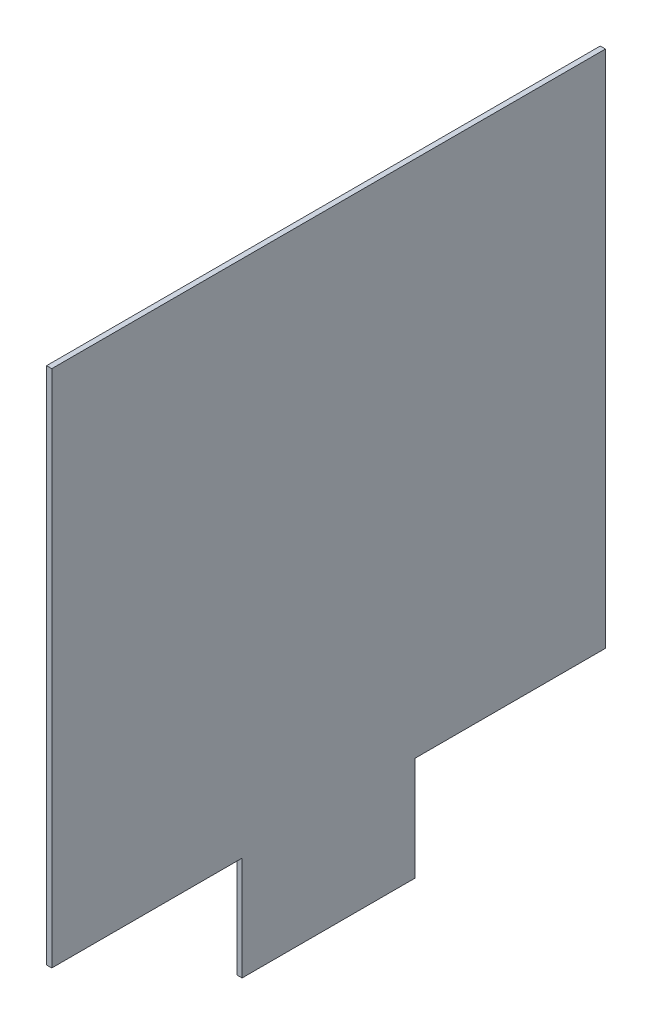
ISO-10303-21;
HEADER;
FILE_DESCRIPTION(('STEP AP214'),'2;1');
FILE_NAME('part.step','',(''),(''),'','','');
FILE_SCHEMA(('AUTOMOTIVE_DESIGN { 1 0 10303 214 1 1 1 1 }'));
ENDSEC;
DATA;
#1=APPLICATION_CONTEXT('core data for automotive mechanical design processes');
#2=APPLICATION_PROTOCOL_DEFINITION('international standard','automotive_design',2000,#1);
#3=PRODUCT_CONTEXT('',#1,'mechanical');
#4=PRODUCT('Part','Part','',(#3));
#5=PRODUCT_RELATED_PRODUCT_CATEGORY('part','',(#4));
#6=PRODUCT_DEFINITION_FORMATION('','',#4);
#7=PRODUCT_DEFINITION_CONTEXT('part definition',#1,'design');
#8=PRODUCT_DEFINITION('design','',#6,#7);
#9=PRODUCT_DEFINITION_SHAPE('','',#8);
#10=(LENGTH_UNIT() NAMED_UNIT(*) SI_UNIT(.MILLI.,.METRE.));
#11=(NAMED_UNIT(*) PLANE_ANGLE_UNIT() SI_UNIT($,.RADIAN.));
#12=(NAMED_UNIT(*) SI_UNIT($,.STERADIAN.) SOLID_ANGLE_UNIT());
#13=UNCERTAINTY_MEASURE_WITH_UNIT(LENGTH_MEASURE(1.E-05),#10,'distance_accuracy_value','');
#14=(GEOMETRIC_REPRESENTATION_CONTEXT(3) GLOBAL_UNCERTAINTY_ASSIGNED_CONTEXT((#13)) GLOBAL_UNIT_ASSIGNED_CONTEXT((#10,
#11,#12)) REPRESENTATION_CONTEXT('',''));
#15=CARTESIAN_POINT('',(0.,0.,0.));
#16=DIRECTION('',(0.,0.,1.));
#17=DIRECTION('',(1.,0.,0.));
#18=AXIS2_PLACEMENT_3D('',#15,#16,#17);
#19=CARTESIAN_POINT('',(3.,-55.7041559783793,-168.725428423783));
#20=DIRECTION('',(0.,0.,1.));
#21=DIRECTION('',(0.,-1.,0.));
#22=AXIS2_PLACEMENT_3D('',#19,#20,#21);
#23=PLANE('',#22);
#24=DIRECTION('',(0.,1.,0.));
#25=VECTOR('',#24,1.);
#26=CARTESIAN_POINT('',(0.,-55.7041559783793,-168.725428423783));
#27=LINE('',#26,#25);
#28=CARTESIAN_POINT('',(0.,-55.7041559783793,-168.725428423783));
#29=VERTEX_POINT('',#28);
#30=CARTESIAN_POINT('',(0.,244.295844021621,-168.725428423783));
#31=VERTEX_POINT('',#30);
#32=EDGE_CURVE('E129',#29,#31,#27,.T.);
#33=ORIENTED_EDGE('',*,*,#32,.T.);
#34=DIRECTION('',(-1.,0.,0.));
#35=VECTOR('',#34,1.);
#36=CARTESIAN_POINT('',(3.,244.295844021621,-168.725428423783));
#37=LINE('',#36,#35);
#38=CARTESIAN_POINT('',(3.,244.295844021621,-168.725428423783));
#39=VERTEX_POINT('',#38);
#40=EDGE_CURVE('E11',#39,#31,#37,.T.);
#41=ORIENTED_EDGE('',*,*,#40,.F.);
#42=DIRECTION('',(0.,1.,0.));
#43=VECTOR('',#42,1.);
#44=CARTESIAN_POINT('',(3.,-55.7041559783793,-168.725428423783));
#45=LINE('',#44,#43);
#46=CARTESIAN_POINT('',(3.,-55.7041559783793,-168.725428423783));
#47=VERTEX_POINT('',#46);
#48=EDGE_CURVE('E143',#47,#39,#45,.T.);
#49=ORIENTED_EDGE('',*,*,#48,.F.);
#50=DIRECTION('',(-1.,0.,0.));
#51=VECTOR('',#50,1.);
#52=CARTESIAN_POINT('',(3.,-55.7041559783793,-168.725428423783));
#53=LINE('',#52,#51);
#54=EDGE_CURVE('E125',#47,#29,#53,.T.);
#55=ORIENTED_EDGE('',*,*,#54,.T.);
#56=EDGE_LOOP('',(#33,#41,#49,#55));
#57=FACE_BOUND('',#56,.T.);
#58=ADVANCED_FACE('F33',(#57),#23,.F.);
#59=CARTESIAN_POINT('',(3.,244.295844021621,151.274571576217));
#60=DIRECTION('',(0.,-1.,0.));
#61=DIRECTION('',(0.,0.,-1.));
#62=AXIS2_PLACEMENT_3D('',#59,#60,#61);
#63=PLANE('',#62);
#64=DIRECTION('',(0.,0.,1.));
#65=VECTOR('',#64,1.);
#66=CARTESIAN_POINT('',(0.,244.295844021621,151.274571576217));
#67=LINE('',#66,#65);
#68=CARTESIAN_POINT('',(0.,244.295844021621,151.274571576217));
#69=VERTEX_POINT('',#68);
#70=EDGE_CURVE('E132',#31,#69,#67,.T.);
#71=ORIENTED_EDGE('',*,*,#70,.T.);
#72=DIRECTION('',(-1.,0.,0.));
#73=VECTOR('',#72,1.);
#74=CARTESIAN_POINT('',(3.,244.295844021621,151.274571576217));
#75=LINE('',#74,#73);
#76=CARTESIAN_POINT('',(3.,244.295844021621,151.274571576217));
#77=VERTEX_POINT('',#76);
#78=EDGE_CURVE('E41',#77,#69,#75,.T.);
#79=ORIENTED_EDGE('',*,*,#78,.F.);
#80=DIRECTION('',(0.,0.,1.));
#81=VECTOR('',#80,1.);
#82=CARTESIAN_POINT('',(3.,244.295844021621,151.274571576217));
#83=LINE('',#82,#81);
#84=EDGE_CURVE('E92',#39,#77,#83,.T.);
#85=ORIENTED_EDGE('',*,*,#84,.F.);
#86=ORIENTED_EDGE('',*,*,#40,.T.);
#87=EDGE_LOOP('',(#71,#79,#85,#86));
#88=FACE_BOUND('',#87,.T.);
#89=ADVANCED_FACE('F178',(#88),#63,.F.);
#90=CARTESIAN_POINT('',(3.,-55.7041559783794,151.274571576217));
#91=DIRECTION('',(0.,0.,-1.));
#92=DIRECTION('',(0.,1.,0.));
#93=AXIS2_PLACEMENT_3D('',#90,#91,#92);
#94=PLANE('',#93);
#95=DIRECTION('',(0.,-1.,0.));
#96=VECTOR('',#95,1.);
#97=CARTESIAN_POINT('',(0.,-55.7041559783794,151.274571576217));
#98=LINE('',#97,#96);
#99=CARTESIAN_POINT('',(0.,-55.7041559783794,151.274571576217));
#100=VERTEX_POINT('',#99);
#101=EDGE_CURVE('E134',#69,#100,#98,.T.);
#102=ORIENTED_EDGE('',*,*,#101,.T.);
#103=DIRECTION('',(-1.,0.,0.));
#104=VECTOR('',#103,1.);
#105=CARTESIAN_POINT('',(3.,-55.7041559783794,151.274571576217));
#106=LINE('',#105,#104);
#107=CARTESIAN_POINT('',(3.,-55.7041559783794,151.274571576217));
#108=VERTEX_POINT('',#107);
#109=EDGE_CURVE('E150',#108,#100,#106,.T.);
#110=ORIENTED_EDGE('',*,*,#109,.F.);
#111=DIRECTION('',(0.,-1.,0.));
#112=VECTOR('',#111,1.);
#113=CARTESIAN_POINT('',(3.,-55.7041559783794,151.274571576217));
#114=LINE('',#113,#112);
#115=EDGE_CURVE('E158',#77,#108,#114,.T.);
#116=ORIENTED_EDGE('',*,*,#115,.F.);
#117=ORIENTED_EDGE('',*,*,#78,.T.);
#118=EDGE_LOOP('',(#102,#110,#116,#117));
#119=FACE_BOUND('',#118,.T.);
#120=ADVANCED_FACE('F156',(#119),#94,.F.);
#121=CARTESIAN_POINT('',(3.,-55.7041559783794,151.274571576217));
#122=DIRECTION('',(0.,1.,0.));
#123=DIRECTION('',(0.,0.,1.));
#124=AXIS2_PLACEMENT_3D('',#121,#122,#123);
#125=PLANE('',#124);
#126=DIRECTION('',(0.,0.,-1.));
#127=VECTOR('',#126,1.);
#128=CARTESIAN_POINT('',(0.,-55.7041559783794,151.274571576217));
#129=LINE('',#128,#127);
#130=CARTESIAN_POINT('',(0.,-55.7041559783794,41.2745715762173));
#131=VERTEX_POINT('',#130);
#132=EDGE_CURVE('E136',#100,#131,#129,.T.);
#133=ORIENTED_EDGE('',*,*,#132,.T.);
#134=DIRECTION('',(-1.,0.,0.));
#135=VECTOR('',#134,1.);
#136=CARTESIAN_POINT('',(3.,-55.7041559783794,41.2745715762173));
#137=LINE('',#136,#135);
#138=CARTESIAN_POINT('',(3.,-55.7041559783794,41.2745715762173));
#139=VERTEX_POINT('',#138);
#140=EDGE_CURVE('E147',#139,#131,#137,.T.);
#141=ORIENTED_EDGE('',*,*,#140,.F.);
#142=DIRECTION('',(0.,0.,-1.));
#143=VECTOR('',#142,1.);
#144=CARTESIAN_POINT('',(3.,-55.7041559783794,151.274571576217));
#145=LINE('',#144,#143);
#146=EDGE_CURVE('E170',#108,#139,#145,.T.);
#147=ORIENTED_EDGE('',*,*,#146,.F.);
#148=ORIENTED_EDGE('',*,*,#109,.T.);
#149=EDGE_LOOP('',(#133,#141,#147,#148));
#150=FACE_BOUND('',#149,.T.);
#151=ADVANCED_FACE('F166',(#150),#125,.F.);
#152=CARTESIAN_POINT('',(3.,-55.7041559783794,41.2745715762173));
#153=DIRECTION('',(0.,0.,-1.));
#154=DIRECTION('',(-1.,0.,0.));
#155=AXIS2_PLACEMENT_3D('',#152,#153,#154);
#156=PLANE('',#155);
#157=DIRECTION('',(0.,-1.,0.));
#158=VECTOR('',#157,1.);
#159=CARTESIAN_POINT('',(0.,-55.7041559783794,41.2745715762173));
#160=LINE('',#159,#158);
#161=CARTESIAN_POINT('',(0.,-115.704155978379,41.2745715762173));
#162=VERTEX_POINT('',#161);
#163=EDGE_CURVE('E138',#131,#162,#160,.T.);
#164=ORIENTED_EDGE('',*,*,#163,.T.);
#165=DIRECTION('',(-1.,0.,0.));
#166=VECTOR('',#165,1.);
#167=CARTESIAN_POINT('',(3.,-115.704155978379,41.2745715762173));
#168=LINE('',#167,#166);
#169=CARTESIAN_POINT('',(3.,-115.704155978379,41.2745715762173));
#170=VERTEX_POINT('',#169);
#171=EDGE_CURVE('E120',#170,#162,#168,.T.);
#172=ORIENTED_EDGE('',*,*,#171,.F.);
#173=DIRECTION('',(0.,-1.,0.));
#174=VECTOR('',#173,1.);
#175=CARTESIAN_POINT('',(3.,-55.7041559783794,41.2745715762173));
#176=LINE('',#175,#174);
#177=EDGE_CURVE('E111',#139,#170,#176,.T.);
#178=ORIENTED_EDGE('',*,*,#177,.F.);
#179=ORIENTED_EDGE('',*,*,#140,.T.);
#180=EDGE_LOOP('',(#164,#172,#178,#179));
#181=FACE_BOUND('',#180,.T.);
#182=ADVANCED_FACE('F169',(#181),#156,.F.);
#183=CARTESIAN_POINT('',(3.,-115.704155978379,41.2745715762173));
#184=DIRECTION('',(0.,1.,0.));
#185=DIRECTION('',(0.,0.,1.));
#186=AXIS2_PLACEMENT_3D('',#183,#184,#185);
#187=PLANE('',#186);
#188=DIRECTION('',(0.,0.,-1.));
#189=VECTOR('',#188,1.);
#190=CARTESIAN_POINT('',(0.,-115.704155978379,41.2745715762173));
#191=LINE('',#190,#189);
#192=CARTESIAN_POINT('',(0.,-115.704155978379,-58.7254284237826));
#193=VERTEX_POINT('',#192);
#194=EDGE_CURVE('E119',#162,#193,#191,.T.);
#195=ORIENTED_EDGE('',*,*,#194,.T.);
#196=DIRECTION('',(-1.,0.,0.));
#197=VECTOR('',#196,1.);
#198=CARTESIAN_POINT('',(3.,-115.704155978379,-58.7254284237826));
#199=LINE('',#198,#197);
#200=CARTESIAN_POINT('',(3.,-115.704155978379,-58.7254284237826));
#201=VERTEX_POINT('',#200);
#202=EDGE_CURVE('E116',#201,#193,#199,.T.);
#203=ORIENTED_EDGE('',*,*,#202,.F.);
#204=DIRECTION('',(0.,0.,-1.));
#205=VECTOR('',#204,1.);
#206=CARTESIAN_POINT('',(3.,-115.704155978379,41.2745715762173));
#207=LINE('',#206,#205);
#208=EDGE_CURVE('E105',#170,#201,#207,.T.);
#209=ORIENTED_EDGE('',*,*,#208,.F.);
#210=ORIENTED_EDGE('',*,*,#171,.T.);
#211=EDGE_LOOP('',(#195,#203,#209,#210));
#212=FACE_BOUND('',#211,.T.);
#213=ADVANCED_FACE('F117',(#212),#187,.F.);
#214=CARTESIAN_POINT('',(3.,-115.704155978379,-58.7254284237826));
#215=DIRECTION('',(0.,0.,1.));
#216=DIRECTION('',(0.,-1.,0.));
#217=AXIS2_PLACEMENT_3D('',#214,#215,#216);
#218=PLANE('',#217);
#219=DIRECTION('',(0.,1.,0.));
#220=VECTOR('',#219,1.);
#221=CARTESIAN_POINT('',(0.,-115.704155978379,-58.7254284237826));
#222=LINE('',#221,#220);
#223=CARTESIAN_POINT('',(0.,-55.7041559783793,-58.7254284237826));
#224=VERTEX_POINT('',#223);
#225=EDGE_CURVE('E78',#193,#224,#222,.T.);
#226=ORIENTED_EDGE('',*,*,#225,.T.);
#227=DIRECTION('',(-1.,0.,0.));
#228=VECTOR('',#227,1.);
#229=CARTESIAN_POINT('',(3.,-55.7041559783793,-58.7254284237826));
#230=LINE('',#229,#228);
#231=CARTESIAN_POINT('',(3.,-55.7041559783793,-58.7254284237826));
#232=VERTEX_POINT('',#231);
#233=EDGE_CURVE('E121',#232,#224,#230,.T.);
#234=ORIENTED_EDGE('',*,*,#233,.F.);
#235=DIRECTION('',(0.,1.,0.));
#236=VECTOR('',#235,1.);
#237=CARTESIAN_POINT('',(3.,-115.704155978379,-58.7254284237826));
#238=LINE('',#237,#236);
#239=EDGE_CURVE('E109',#201,#232,#238,.T.);
#240=ORIENTED_EDGE('',*,*,#239,.F.);
#241=ORIENTED_EDGE('',*,*,#202,.T.);
#242=EDGE_LOOP('',(#226,#234,#240,#241));
#243=FACE_BOUND('',#242,.T.);
#244=ADVANCED_FACE('F123',(#243),#218,.F.);
#245=CARTESIAN_POINT('',(3.,-55.7041559783793,-58.7254284237826));
#246=DIRECTION('',(0.,1.,0.));
#247=DIRECTION('',(0.,0.,1.));
#248=AXIS2_PLACEMENT_3D('',#245,#246,#247);
#249=PLANE('',#248);
#250=DIRECTION('',(0.,0.,-1.));
#251=VECTOR('',#250,1.);
#252=CARTESIAN_POINT('',(0.,-55.7041559783793,-58.7254284237826));
#253=LINE('',#252,#251);
#254=EDGE_CURVE('E84',#224,#29,#253,.T.);
#255=ORIENTED_EDGE('',*,*,#254,.T.);
#256=ORIENTED_EDGE('',*,*,#54,.F.);
#257=DIRECTION('',(0.,0.,-1.));
#258=VECTOR('',#257,1.);
#259=CARTESIAN_POINT('',(3.,-55.7041559783793,-58.7254284237826));
#260=LINE('',#259,#258);
#261=EDGE_CURVE('E49',#232,#47,#260,.T.);
#262=ORIENTED_EDGE('',*,*,#261,.F.);
#263=ORIENTED_EDGE('',*,*,#233,.T.);
#264=EDGE_LOOP('',(#255,#256,#262,#263));
#265=FACE_BOUND('',#264,.T.);
#266=ADVANCED_FACE('F194',(#265),#249,.F.);
#267=CARTESIAN_POINT('',(3.,0.,0.));
#268=DIRECTION('',(-1.,0.,0.));
#269=DIRECTION('',(0.,0.,1.));
#270=AXIS2_PLACEMENT_3D('',#267,#268,#269);
#271=PLANE('',#270);
#272=ORIENTED_EDGE('',*,*,#48,.T.);
#273=ORIENTED_EDGE('',*,*,#84,.T.);
#274=ORIENTED_EDGE('',*,*,#115,.T.);
#275=ORIENTED_EDGE('',*,*,#146,.T.);
#276=ORIENTED_EDGE('',*,*,#177,.T.);
#277=ORIENTED_EDGE('',*,*,#208,.T.);
#278=ORIENTED_EDGE('',*,*,#239,.T.);
#279=ORIENTED_EDGE('',*,*,#261,.T.);
#280=EDGE_LOOP('',(#272,#273,#274,#275,#276,#277,#278,#279));
#281=FACE_BOUND('',#280,.T.);
#282=ADVANCED_FACE('F107',(#281),#271,.F.);
#283=CARTESIAN_POINT('',(0.,0.,0.));
#284=DIRECTION('',(-1.,0.,0.));
#285=DIRECTION('',(0.,0.,1.));
#286=AXIS2_PLACEMENT_3D('',#283,#284,#285);
#287=PLANE('',#286);
#288=ORIENTED_EDGE('',*,*,#32,.F.);
#289=ORIENTED_EDGE('',*,*,#254,.F.);
#290=ORIENTED_EDGE('',*,*,#225,.F.);
#291=ORIENTED_EDGE('',*,*,#194,.F.);
#292=ORIENTED_EDGE('',*,*,#163,.F.);
#293=ORIENTED_EDGE('',*,*,#132,.F.);
#294=ORIENTED_EDGE('',*,*,#101,.F.);
#295=ORIENTED_EDGE('',*,*,#70,.F.);
#296=EDGE_LOOP('',(#288,#289,#290,#291,#292,#293,#294,#295));
#297=FACE_BOUND('',#296,.T.);
#298=ADVANCED_FACE('F162',(#297),#287,.T.);
#299=CLOSED_SHELL('',(#58,#89,#120,#151,#182,#213,#244,#266,#282,#298));
#300=MANIFOLD_SOLID_BREP('B2',#299);
#301=ADVANCED_BREP_SHAPE_REPRESENTATION('',(#18,#300),#14);
#302=SHAPE_DEFINITION_REPRESENTATION(#9,#301);
ENDSEC;
END-ISO-10303-21;
